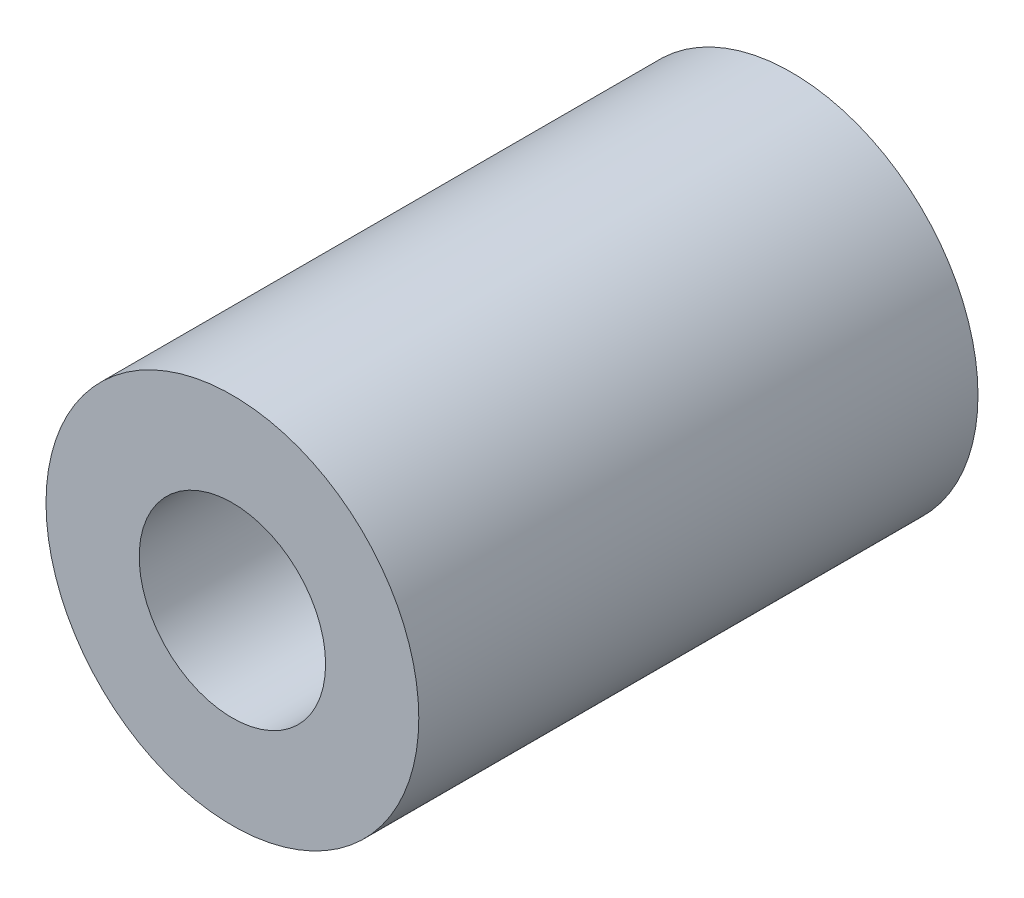
ISO-10303-21;
HEADER;
FILE_DESCRIPTION(('STEP AP214'),'2;1');
FILE_NAME('part.step','',(''),(''),'','','');
FILE_SCHEMA(('AUTOMOTIVE_DESIGN { 1 0 10303 214 1 1 1 1 }'));
ENDSEC;
DATA;
#1=APPLICATION_CONTEXT('core data for automotive mechanical design processes');
#2=APPLICATION_PROTOCOL_DEFINITION('international standard','automotive_design',2000,#1);
#3=PRODUCT_CONTEXT('',#1,'mechanical');
#4=PRODUCT('Part','Part','',(#3));
#5=PRODUCT_RELATED_PRODUCT_CATEGORY('part','',(#4));
#6=PRODUCT_DEFINITION_FORMATION('','',#4);
#7=PRODUCT_DEFINITION_CONTEXT('part definition',#1,'design');
#8=PRODUCT_DEFINITION('design','',#6,#7);
#9=PRODUCT_DEFINITION_SHAPE('','',#8);
#10=(LENGTH_UNIT() NAMED_UNIT(*) SI_UNIT(.MILLI.,.METRE.));
#11=(NAMED_UNIT(*) PLANE_ANGLE_UNIT() SI_UNIT($,.RADIAN.));
#12=(NAMED_UNIT(*) SI_UNIT($,.STERADIAN.) SOLID_ANGLE_UNIT());
#13=UNCERTAINTY_MEASURE_WITH_UNIT(LENGTH_MEASURE(1.E-05),#10,'distance_accuracy_value','');
#14=(GEOMETRIC_REPRESENTATION_CONTEXT(3) GLOBAL_UNCERTAINTY_ASSIGNED_CONTEXT((#13)) GLOBAL_UNIT_ASSIGNED_CONTEXT((#10,
#11,#12)) REPRESENTATION_CONTEXT('',''));
#15=CARTESIAN_POINT('',(0.,0.,0.));
#16=DIRECTION('',(0.,0.,1.));
#17=DIRECTION('',(1.,0.,0.));
#18=AXIS2_PLACEMENT_3D('',#15,#16,#17);
#19=CARTESIAN_POINT('',(-42.926,182.88,-25.4));
#20=DIRECTION('',(0.,0.,1.));
#21=DIRECTION('',(1.,0.,0.));
#22=AXIS2_PLACEMENT_3D('',#19,#20,#21);
#23=CYLINDRICAL_SURFACE('',#22,12.7);
#24=CARTESIAN_POINT('',(-42.926,182.88,-25.4));
#25=DIRECTION('',(0.,0.,1.));
#26=DIRECTION('',(1.,0.,0.));
#27=AXIS2_PLACEMENT_3D('',#24,#25,#26);
#28=CIRCLE('',#27,12.7);
#29=CARTESIAN_POINT('',(-30.226,182.88,-25.4));
#30=VERTEX_POINT('',#29);
#31=EDGE_CURVE('E10',#30,#30,#28,.T.);
#32=ORIENTED_EDGE('',*,*,#31,.T.);
#33=EDGE_LOOP('',(#32));
#34=FACE_BOUND('',#33,.T.);
#35=CARTESIAN_POINT('',(-42.926,182.88,12.7));
#36=DIRECTION('',(0.,0.,1.));
#37=DIRECTION('',(1.,0.,0.));
#38=AXIS2_PLACEMENT_3D('',#35,#36,#37);
#39=CIRCLE('',#38,12.7);
#40=CARTESIAN_POINT('',(-30.226,182.88,12.7));
#41=VERTEX_POINT('',#40);
#42=EDGE_CURVE('E47',#41,#41,#39,.T.);
#43=ORIENTED_EDGE('',*,*,#42,.F.);
#44=EDGE_LOOP('',(#43));
#45=FACE_BOUND('',#44,.T.);
#46=ADVANCED_FACE('F37',(#34,#45),#23,.T.);
#47=CARTESIAN_POINT('',(-42.926,182.88,-25.4));
#48=DIRECTION('',(0.,0.,1.));
#49=DIRECTION('',(1.,0.,0.));
#50=AXIS2_PLACEMENT_3D('',#47,#48,#49);
#51=PLANE('',#50);
#52=CARTESIAN_POINT('',(-42.926,182.88,-25.4));
#53=DIRECTION('',(0.,0.,1.));
#54=DIRECTION('',(1.,0.,0.));
#55=AXIS2_PLACEMENT_3D('',#52,#53,#54);
#56=CIRCLE('',#55,6.35);
#57=CARTESIAN_POINT('',(-36.576,182.88,-25.4));
#58=VERTEX_POINT('',#57);
#59=EDGE_CURVE('E43',#58,#58,#56,.T.);
#60=ORIENTED_EDGE('',*,*,#59,.T.);
#61=EDGE_LOOP('',(#60));
#62=FACE_BOUND('',#61,.T.);
#63=ORIENTED_EDGE('',*,*,#31,.F.);
#64=EDGE_LOOP('',(#63));
#65=FACE_BOUND('',#64,.T.);
#66=ADVANCED_FACE('F66',(#62,#65),#51,.F.);
#67=CARTESIAN_POINT('',(-42.926,182.88,-25.4));
#68=DIRECTION('',(0.,0.,1.));
#69=DIRECTION('',(1.,0.,0.));
#70=AXIS2_PLACEMENT_3D('',#67,#68,#69);
#71=CYLINDRICAL_SURFACE('',#70,6.35);
#72=ORIENTED_EDGE('',*,*,#59,.F.);
#73=EDGE_LOOP('',(#72));
#74=FACE_BOUND('',#73,.T.);
#75=CARTESIAN_POINT('',(-42.926,182.88,12.7));
#76=DIRECTION('',(0.,0.,1.));
#77=DIRECTION('',(1.,0.,0.));
#78=AXIS2_PLACEMENT_3D('',#75,#76,#77);
#79=CIRCLE('',#78,6.35);
#80=CARTESIAN_POINT('',(-36.576,182.88,12.7));
#81=VERTEX_POINT('',#80);
#82=EDGE_CURVE('E51',#81,#81,#79,.T.);
#83=ORIENTED_EDGE('',*,*,#82,.T.);
#84=EDGE_LOOP('',(#83));
#85=FACE_BOUND('',#84,.T.);
#86=ADVANCED_FACE('F57',(#74,#85),#71,.F.);
#87=CARTESIAN_POINT('',(-42.926,182.88,12.7));
#88=DIRECTION('',(0.,0.,1.));
#89=DIRECTION('',(1.,0.,0.));
#90=AXIS2_PLACEMENT_3D('',#87,#88,#89);
#91=PLANE('',#90);
#92=ORIENTED_EDGE('',*,*,#42,.T.);
#93=EDGE_LOOP('',(#92));
#94=FACE_BOUND('',#93,.T.);
#95=ORIENTED_EDGE('',*,*,#82,.F.);
#96=EDGE_LOOP('',(#95));
#97=FACE_BOUND('',#96,.T.);
#98=ADVANCED_FACE('F59',(#94,#97),#91,.T.);
#99=CLOSED_SHELL('',(#46,#66,#86,#98));
#100=MANIFOLD_SOLID_BREP('B2',#99);
#101=ADVANCED_BREP_SHAPE_REPRESENTATION('',(#18,#100),#14);
#102=SHAPE_DEFINITION_REPRESENTATION(#9,#101);
ENDSEC;
END-ISO-10303-21;
